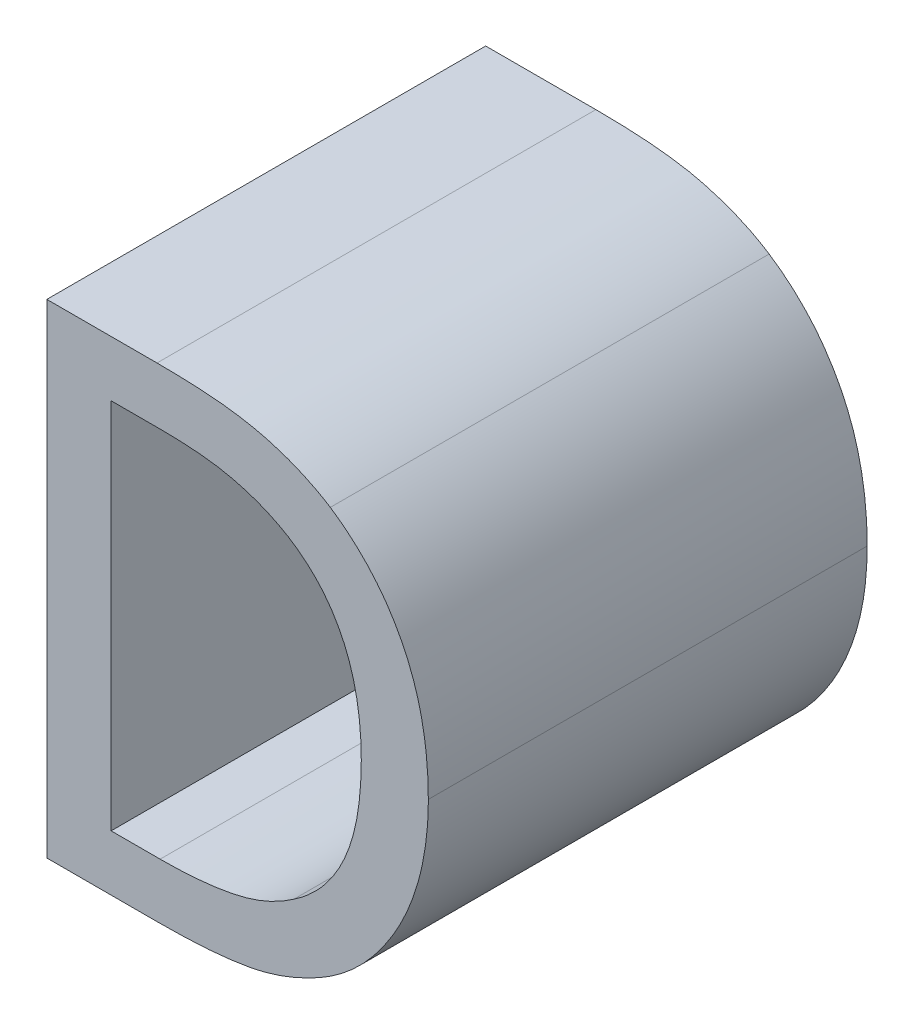
ISO-10303-21;
HEADER;
FILE_DESCRIPTION(('STEP AP214'),'2;1');
FILE_NAME('part.step','',(''),(''),'','','');
FILE_SCHEMA(('AUTOMOTIVE_DESIGN { 1 0 10303 214 1 1 1 1 }'));
ENDSEC;
DATA;
#1=APPLICATION_CONTEXT('core data for automotive mechanical design processes');
#2=APPLICATION_PROTOCOL_DEFINITION('international standard','automotive_design',2000,#1);
#3=PRODUCT_CONTEXT('',#1,'mechanical');
#4=PRODUCT('Part','Part','',(#3));
#5=PRODUCT_RELATED_PRODUCT_CATEGORY('part','',(#4));
#6=PRODUCT_DEFINITION_FORMATION('','',#4);
#7=PRODUCT_DEFINITION_CONTEXT('part definition',#1,'design');
#8=PRODUCT_DEFINITION('design','',#6,#7);
#9=PRODUCT_DEFINITION_SHAPE('','',#8);
#10=(LENGTH_UNIT() NAMED_UNIT(*) SI_UNIT(.MILLI.,.METRE.));
#11=(NAMED_UNIT(*) PLANE_ANGLE_UNIT() SI_UNIT($,.RADIAN.));
#12=(NAMED_UNIT(*) SI_UNIT($,.STERADIAN.) SOLID_ANGLE_UNIT());
#13=UNCERTAINTY_MEASURE_WITH_UNIT(LENGTH_MEASURE(1.E-05),#10,'distance_accuracy_value','');
#14=(GEOMETRIC_REPRESENTATION_CONTEXT(3) GLOBAL_UNCERTAINTY_ASSIGNED_CONTEXT((#13)) GLOBAL_UNIT_ASSIGNED_CONTEXT((#10,
#11,#12)) REPRESENTATION_CONTEXT('',''));
#15=CARTESIAN_POINT('',(0.,0.,0.));
#16=DIRECTION('',(0.,0.,1.));
#17=DIRECTION('',(1.,0.,0.));
#18=AXIS2_PLACEMENT_3D('',#15,#16,#17);
#19=CARTESIAN_POINT('',(-0.57336018621223,-0.78151699205063,0.));
#20=CARTESIAN_POINT('',(-0.57336018621223,-0.78151699205063,0.1));
#21=CARTESIAN_POINT('',(-0.565676636526099,-0.776335063192542,0.));
#22=CARTESIAN_POINT('',(-0.565676636526099,-0.776335063192542,0.1));
#23=CARTESIAN_POINT('',(-0.557993086839968,-0.759181091800249,0.));
#24=CARTESIAN_POINT('',(-0.557993086839968,-0.759181091800249,0.1));
#25=CARTESIAN_POINT('',(-0.557993086839968,-0.746315613256029,0.));
#26=CARTESIAN_POINT('',(-0.557993086839968,-0.746315613256029,0.1));
#27=B_SPLINE_SURFACE_WITH_KNOTS('',2,1,((#19,#20),(#21,#22),(#23,#24),(#25,#26)),.UNSPECIFIED.,
.F.,.F.,.F.,(3,1,3),(2,2),(0.,0.5,1.),(0.,1.),.UNSPECIFIED.);
#28=CARTESIAN_POINT('',(-0.57336018621223,-0.78151699205063,0.));
#29=CARTESIAN_POINT('',(-0.571974064499115,-0.780586004854194,0.));
#30=CARTESIAN_POINT('',(-0.570659374096423,-0.779549621493118,0.));
#31=CARTESIAN_POINT('',(-0.568210307998909,-0.777289324570812,0.));
#32=CARTESIAN_POINT('',(-0.567075393979872,-0.776065993286295,0.));
#33=CARTESIAN_POINT('',(-0.564032264183,-0.772201998895634,0.));
#34=CARTESIAN_POINT('',(-0.56241804529149,-0.769321800062823,0.));
#35=CARTESIAN_POINT('',(-0.559920581166913,-0.763013413304652,0.));
#36=CARTESIAN_POINT('',(-0.559110338615604,-0.759559503613566,0.));
#37=CARTESIAN_POINT('',(-0.558179322670335,-0.752819033089759,0.));
#38=CARTESIAN_POINT('',(-0.558010958480128,-0.749539622327566,0.));
#39=CARTESIAN_POINT('',(-0.557993086839968,-0.746315613256029,0.));
#40=B_SPLINE_CURVE_WITH_KNOTS('',3,(#28,#29,#30,#31,#32,#33,#34,#35,#36,#37,#38,#39),
.UNSPECIFIED.,.F.,.F.,(4,2,2,2,2,4),(0.,0.00500283621021951,0.00999039651425222,
0.0197318708524399,0.030293679025087,0.0400551929748056),.UNSPECIFIED.);
#41=CARTESIAN_POINT('',(-0.57336018621223,-0.78151699205063,0.));
#42=VERTEX_POINT('',#41);
#43=CARTESIAN_POINT('',(-0.557993086839968,-0.746315613256029,0.));
#44=VERTEX_POINT('',#43);
#45=EDGE_CURVE('E11',#42,#44,#40,.T.);
#46=DIRECTION('',(0.,0.,1.));
#47=VECTOR('',#46,1.);
#48=CARTESIAN_POINT('',(-0.57336018621223,-0.78151699205063,0.));
#49=LINE('',#48,#47);
#50=CARTESIAN_POINT('',(-0.57336018621223,-0.78151699205063,0.1));
#51=VERTEX_POINT('',#50);
#52=EDGE_CURVE('E254',#42,#51,#49,.T.);
#53=CARTESIAN_POINT('',(-0.557993086839968,-0.746315613256029,0.1));
#54=CARTESIAN_POINT('',(-0.55800529303414,-0.748901372805465,0.1));
#55=CARTESIAN_POINT('',(-0.558113369773259,-0.75150009986584,0.1));
#56=CARTESIAN_POINT('',(-0.558656851746064,-0.756695599338601,0.1));
#57=CARTESIAN_POINT('',(-0.559096649048212,-0.759291873337756,0.1));
#58=CARTESIAN_POINT('',(-0.560664166489674,-0.765204023709619,0.1));
#59=CARTESIAN_POINT('',(-0.56196829723751,-0.768481239153434,0.1));
#60=CARTESIAN_POINT('',(-0.565382887417428,-0.77413702258923,0.1));
#61=CARTESIAN_POINT('',(-0.567394379080186,-0.776573802677838,0.1));
#62=CARTESIAN_POINT('',(-0.570854142771335,-0.779706084052975,0.1));
#63=CARTESIAN_POINT('',(-0.572076166423392,-0.780660618383883,0.1));
#64=CARTESIAN_POINT('',(-0.573360186269095,-0.781516992088981,0.1));
#65=B_SPLINE_CURVE_WITH_KNOTS('',3,(#53,#54,#55,#56,#57,#58,#59,#60,#61,#62,#63,#64),
.UNSPECIFIED.,.F.,.F.,(4,2,2,2,2,4),(0.,0.00777464567562108,0.0156540772552479,
0.0260804222293015,0.0354127228769543,0.0400469014535127),.UNSPECIFIED.);
#66=CARTESIAN_POINT('',(-0.557993086839968,-0.746315613256029,0.1));
#67=VERTEX_POINT('',#66);
#68=EDGE_CURVE('E261',#67,#51,#65,.T.);
#69=DIRECTION('',(0.,0.,1.));
#70=VECTOR('',#69,1.);
#71=CARTESIAN_POINT('',(-0.557993086839968,-0.746315613256029,0.));
#72=LINE('',#71,#70);
#73=EDGE_CURVE('E280',#44,#67,#72,.T.);
#74=ORIENTED_EDGE('',*,*,#45,.F.);
#75=ORIENTED_EDGE('',*,*,#52,.T.);
#76=ORIENTED_EDGE('',*,*,#68,.F.);
#77=ORIENTED_EDGE('',*,*,#73,.F.);
#78=EDGE_LOOP('',(#74,#75,#76,#77));
#79=FACE_BOUND('',#78,.T.);
#80=ADVANCED_FACE('F17',(#79),#27,.F.);
#81=CARTESIAN_POINT('',(-0.603826354153751,-0.788843167332755,0.));
#82=CARTESIAN_POINT('',(-0.603826354153751,-0.788843167332755,0.1));
#83=CARTESIAN_POINT('',(-0.594087901644584,-0.788843167332755,0.));
#84=CARTESIAN_POINT('',(-0.594087901644584,-0.788843167332755,0.1));
#85=CARTESIAN_POINT('',(-0.579346207479332,-0.785716141297702,0.));
#86=CARTESIAN_POINT('',(-0.579346207479332,-0.785716141297702,0.1));
#87=CARTESIAN_POINT('',(-0.57336018621223,-0.78151699205063,0.));
#88=CARTESIAN_POINT('',(-0.57336018621223,-0.78151699205063,0.1));
#89=B_SPLINE_SURFACE_WITH_KNOTS('',2,1,((#81,#82),(#83,#84),(#85,#86),(#87,#88)),.UNSPECIFIED.,
.F.,.F.,.F.,(3,1,3),(2,2),(0.,0.5,1.),(0.,1.),.UNSPECIFIED.);
#90=CARTESIAN_POINT('',(-0.603826354153751,-0.788843167332755,0.));
#91=CARTESIAN_POINT('',(-0.600998347678531,-0.788810860575393,0.));
#92=CARTESIAN_POINT('',(-0.598149254573237,-0.788730772281216,0.));
#93=CARTESIAN_POINT('',(-0.592422383887495,-0.788280432587895,0.));
#94=CARTESIAN_POINT('',(-0.589545102750384,-0.78790465063708,0.));
#95=CARTESIAN_POINT('',(-0.584873881218276,-0.786872314523407,0.));
#96=CARTESIAN_POINT('',(-0.583051620790868,-0.786359114745231,0.));
#97=CARTESIAN_POINT('',(-0.579527640772833,-0.785043280695589,0.));
#98=CARTESIAN_POINT('',(-0.577825128337813,-0.784242818339729,0.));
#99=CARTESIAN_POINT('',(-0.575223217417328,-0.782759856601411,0.));
#100=CARTESIAN_POINT('',(-0.574276194469187,-0.78215938182593,0.));
#101=CARTESIAN_POINT('',(-0.573360186168784,-0.781516992020153,0.));
#102=B_SPLINE_CURVE_WITH_KNOTS('',3,(#90,#91,#92,#93,#94,#95,#96,#97,#98,#99,#100,#101),
.UNSPECIFIED.,.F.,.F.,(4,2,2,2,2,4),(0.,0.00851996682632826,0.0172031889020703,0.02286245720336,
0.0284798088608754,0.0318380470037039),.UNSPECIFIED.);
#103=CARTESIAN_POINT('',(-0.603826354153751,-0.788843167332755,0.));
#104=VERTEX_POINT('',#103);
#105=EDGE_CURVE('E32',#104,#42,#102,.T.);
#106=DIRECTION('',(0.,0.,1.));
#107=VECTOR('',#106,1.);
#108=CARTESIAN_POINT('',(-0.603826354153751,-0.788843167332755,0.));
#109=LINE('',#108,#107);
#110=CARTESIAN_POINT('',(-0.603826354153751,-0.788843167332755,0.1));
#111=VERTEX_POINT('',#110);
#112=EDGE_CURVE('E259',#104,#111,#109,.T.);
#113=CARTESIAN_POINT('',(-0.57336018621223,-0.78151699205063,0.1));
#114=CARTESIAN_POINT('',(-0.574853987948286,-0.782566061308256,0.1));
#115=CARTESIAN_POINT('',(-0.576430543282242,-0.783499948944935,0.1));
#116=CARTESIAN_POINT('',(-0.579683438222522,-0.785103860242563,0.1));
#117=CARTESIAN_POINT('',(-0.581357950903033,-0.785777592253888,0.1));
#118=CARTESIAN_POINT('',(-0.585044688873533,-0.786941088179583,0.1));
#119=CARTESIAN_POINT('',(-0.587069928987957,-0.787388178881423,0.1));
#120=CARTESIAN_POINT('',(-0.591158158191194,-0.788084165524177,0.1));
#121=CARTESIAN_POINT('',(-0.593221277910507,-0.78833214200787,0.1));
#122=CARTESIAN_POINT('',(-0.596715204522803,-0.788625454054499,0.1));
#123=CARTESIAN_POINT('',(-0.598142821825889,-0.788709848031575,0.1));
#124=CARTESIAN_POINT('',(-0.60098925672141,-0.788818344146986,0.1));
#125=CARTESIAN_POINT('',(-0.602408056017505,-0.788842911767725,0.1));
#126=CARTESIAN_POINT('',(-0.603826354153751,-0.788843167332755,0.1));
#127=B_SPLINE_CURVE_WITH_KNOTS('',3,(#113,#114,#115,#116,#117,#118,#119,#120,#121,#122,#123,
#124,#125,#126),.UNSPECIFIED.,.F.,.F.,(4,2,2,2,2,2,4),(0.,0.00547388563976892,0.010866578802471,
0.0170670445424434,0.0232959803481711,0.0275849281018604,0.0318403972934729),.UNSPECIFIED.);
#128=EDGE_CURVE('E273',#51,#111,#127,.T.);
#129=ORIENTED_EDGE('',*,*,#105,.F.);
#130=ORIENTED_EDGE('',*,*,#112,.T.);
#131=ORIENTED_EDGE('',*,*,#128,.F.);
#132=ORIENTED_EDGE('',*,*,#52,.F.);
#133=EDGE_LOOP('',(#129,#130,#131,#132));
#134=FACE_BOUND('',#133,.T.);
#135=ADVANCED_FACE('F196',(#134),#89,.F.);
#136=CARTESIAN_POINT('',(-0.614994304278941,-0.788843167332755,0.));
#137=DIRECTION('',(0.,-1.,0.));
#138=DIRECTION('',(1.,0.,0.));
#139=AXIS2_PLACEMENT_3D('',#136,#137,#138);
#140=PLANE('',#139);
#141=DIRECTION('',(1.,0.,0.));
#142=VECTOR('',#141,1.);
#143=CARTESIAN_POINT('',(-0.614994304278941,-0.788843167332755,0.));
#144=LINE('',#143,#142);
#145=CARTESIAN_POINT('',(-0.614994304278941,-0.788843167332755,0.));
#146=VERTEX_POINT('',#145);
#147=EDGE_CURVE('E256',#146,#104,#144,.T.);
#148=ORIENTED_EDGE('',*,*,#147,.F.);
#149=DIRECTION('',(0.,0.,1.));
#150=VECTOR('',#149,1.);
#151=CARTESIAN_POINT('',(-0.614994304278941,-0.788843167332755,0.));
#152=LINE('',#151,#150);
#153=CARTESIAN_POINT('',(-0.614994304278941,-0.788843167332755,0.1));
#154=VERTEX_POINT('',#153);
#155=EDGE_CURVE('E271',#146,#154,#152,.T.);
#156=ORIENTED_EDGE('',*,*,#155,.T.);
#157=DIRECTION('',(-1.,0.,0.));
#158=VECTOR('',#157,1.);
#159=CARTESIAN_POINT('',(-0.603826354153751,-0.788843167332755,0.1));
#160=LINE('',#159,#158);
#161=EDGE_CURVE('E287',#111,#154,#160,.T.);
#162=ORIENTED_EDGE('',*,*,#161,.F.);
#163=ORIENTED_EDGE('',*,*,#112,.F.);
#164=EDGE_LOOP('',(#148,#156,#162,#163));
#165=FACE_BOUND('',#164,.T.);
#166=ADVANCED_FACE('F195',(#165),#140,.F.);
#167=CARTESIAN_POINT('',(-0.614994304278941,-0.703966746381305,0.));
#168=DIRECTION('',(-1.,0.,0.));
#169=DIRECTION('',(0.,-1.,0.));
#170=AXIS2_PLACEMENT_3D('',#167,#168,#169);
#171=PLANE('',#170);
#172=DIRECTION('',(0.,-1.,0.));
#173=VECTOR('',#172,1.);
#174=CARTESIAN_POINT('',(-0.614994304278941,-0.703966746381305,0.));
#175=LINE('',#174,#173);
#176=CARTESIAN_POINT('',(-0.614994304278941,-0.703966746381305,0.));
#177=VERTEX_POINT('',#176);
#178=EDGE_CURVE('E268',#177,#146,#175,.T.);
#179=ORIENTED_EDGE('',*,*,#178,.F.);
#180=DIRECTION('',(0.,0.,1.));
#181=VECTOR('',#180,1.);
#182=CARTESIAN_POINT('',(-0.614994304278941,-0.703966746381305,0.));
#183=LINE('',#182,#181);
#184=CARTESIAN_POINT('',(-0.614994304278941,-0.703966746381305,0.1));
#185=VERTEX_POINT('',#184);
#186=EDGE_CURVE('E286',#177,#185,#183,.T.);
#187=ORIENTED_EDGE('',*,*,#186,.T.);
#188=DIRECTION('',(0.,1.,0.));
#189=VECTOR('',#188,1.);
#190=CARTESIAN_POINT('',(-0.614994304278941,-0.788843167332755,0.1));
#191=LINE('',#190,#189);
#192=EDGE_CURVE('E295',#154,#185,#191,.T.);
#193=ORIENTED_EDGE('',*,*,#192,.F.);
#194=ORIENTED_EDGE('',*,*,#155,.F.);
#195=EDGE_LOOP('',(#179,#187,#193,#194));
#196=FACE_BOUND('',#195,.T.);
#197=ADVANCED_FACE('F403',(#196),#171,.F.);
#198=CARTESIAN_POINT('',(-0.603826354153751,-0.703966746381305,0.));
#199=DIRECTION('',(0.,1.,0.));
#200=DIRECTION('',(-1.,0.,0.));
#201=AXIS2_PLACEMENT_3D('',#198,#199,#200);
#202=PLANE('',#201);
#203=DIRECTION('',(-1.,0.,0.));
#204=VECTOR('',#203,1.);
#205=CARTESIAN_POINT('',(-0.603826354153751,-0.703966746381305,0.));
#206=LINE('',#205,#204);
#207=CARTESIAN_POINT('',(-0.603826354153751,-0.703966746381305,0.));
#208=VERTEX_POINT('',#207);
#209=EDGE_CURVE('E283',#208,#177,#206,.T.);
#210=ORIENTED_EDGE('',*,*,#209,.F.);
#211=DIRECTION('',(0.,0.,1.));
#212=VECTOR('',#211,1.);
#213=CARTESIAN_POINT('',(-0.603826354153751,-0.703966746381305,0.));
#214=LINE('',#213,#212);
#215=CARTESIAN_POINT('',(-0.603826354153751,-0.703966746381305,0.1));
#216=VERTEX_POINT('',#215);
#217=EDGE_CURVE('E292',#208,#216,#214,.T.);
#218=ORIENTED_EDGE('',*,*,#217,.T.);
#219=DIRECTION('',(1.,0.,0.));
#220=VECTOR('',#219,1.);
#221=CARTESIAN_POINT('',(-0.614994304278941,-0.703966746381305,0.1));
#222=LINE('',#221,#220);
#223=EDGE_CURVE('E304',#185,#216,#222,.T.);
#224=ORIENTED_EDGE('',*,*,#223,.F.);
#225=ORIENTED_EDGE('',*,*,#186,.F.);
#226=EDGE_LOOP('',(#210,#218,#224,#225));
#227=FACE_BOUND('',#226,.T.);
#228=ADVANCED_FACE('F327',(#227),#202,.F.);
#229=CARTESIAN_POINT('',(-0.574700340227253,-0.710578172855418,0.));
#230=CARTESIAN_POINT('',(-0.574700340227253,-0.710578172855418,0.1));
#231=CARTESIAN_POINT('',(-0.580597017893354,-0.707093772416359,0.));
#232=CARTESIAN_POINT('',(-0.580597017893354,-0.707093772416359,0.1));
#233=CARTESIAN_POINT('',(-0.593909214442581,-0.703966746381305,0.));
#234=CARTESIAN_POINT('',(-0.593909214442581,-0.703966746381305,0.1));
#235=CARTESIAN_POINT('',(-0.603826354153751,-0.703966746381305,0.));
#236=CARTESIAN_POINT('',(-0.603826354153751,-0.703966746381305,0.1));
#237=B_SPLINE_SURFACE_WITH_KNOTS('',2,1,((#229,#230),(#231,#232),(#233,#234),(#235,#236)),
.UNSPECIFIED.,.F.,.F.,.F.,(3,1,3),(2,2),(0.,0.5,1.),(0.,1.),.UNSPECIFIED.);
#238=CARTESIAN_POINT('',(-0.574700340227253,-0.710578172855418,0.));
#239=CARTESIAN_POINT('',(-0.576657726956662,-0.709415813427964,0.));
#240=CARTESIAN_POINT('',(-0.578707935494003,-0.708406786820412,0.));
#241=CARTESIAN_POINT('',(-0.58291209872132,-0.706722584762168,0.));
#242=CARTESIAN_POINT('',(-0.585064475406915,-0.706043472146908,0.));
#243=CARTESIAN_POINT('',(-0.590130077472695,-0.704855642877207,0.));
#244=CARTESIAN_POINT('',(-0.593069699541249,-0.704467685046455,0.));
#245=CARTESIAN_POINT('',(-0.59862468685714,-0.704051212499679,0.));
#246=CARTESIAN_POINT('',(-0.601237003851355,-0.703985413066877,0.));
#247=CARTESIAN_POINT('',(-0.603826354153751,-0.703966746381305,0.));
#248=B_SPLINE_CURVE_WITH_KNOTS('',3,(#238,#239,#240,#241,#242,#243,#244,#245,#246,#247),
.UNSPECIFIED.,.F.,.F.,(4,2,2,2,4),(0.,0.00682634382907425,0.0135690891273074,0.0224324063312279,
0.0302408276179127),.UNSPECIFIED.);
#249=CARTESIAN_POINT('',(-0.574700340227253,-0.710578172855418,0.));
#250=VERTEX_POINT('',#249);
#251=EDGE_CURVE('E241',#250,#208,#248,.T.);
#252=DIRECTION('',(0.,0.,1.));
#253=VECTOR('',#252,1.);
#254=CARTESIAN_POINT('',(-0.574700340227253,-0.710578172855418,0.));
#255=LINE('',#254,#253);
#256=CARTESIAN_POINT('',(-0.574700340227253,-0.710578172855418,0.1));
#257=VERTEX_POINT('',#256);
#258=EDGE_CURVE('E302',#250,#257,#255,.T.);
#259=CARTESIAN_POINT('',(-0.603826354153751,-0.703966746381305,0.1));
#260=CARTESIAN_POINT('',(-0.601454331224949,-0.703986630810853,0.1));
#261=CARTESIAN_POINT('',(-0.599070082027118,-0.704040470982053,0.1));
#262=CARTESIAN_POINT('',(-0.5943051386019,-0.704354529130428,0.1));
#263=CARTESIAN_POINT('',(-0.591924523201463,-0.704615788463975,0.1));
#264=CARTESIAN_POINT('',(-0.586796075436872,-0.705564067395508,0.1));
#265=CARTESIAN_POINT('',(-0.584059301212245,-0.706319276136312,0.1));
#266=CARTESIAN_POINT('',(-0.579091148890737,-0.70821246717781,0.1));
#267=CARTESIAN_POINT('',(-0.576838241787665,-0.709294763107922,0.1));
#268=CARTESIAN_POINT('',(-0.574700340226908,-0.710578172855622,0.1));
#269=B_SPLINE_CURVE_WITH_KNOTS('',3,(#259,#260,#261,#262,#263,#264,#265,#266,#267,#268),
.UNSPECIFIED.,.F.,.F.,(4,2,2,2,4),(0.,0.0071364590816535,0.0143089753629661,0.0227729142928161,
0.0302380546586502),.UNSPECIFIED.);
#270=EDGE_CURVE('E310',#216,#257,#269,.T.);
#271=ORIENTED_EDGE('',*,*,#251,.F.);
#272=ORIENTED_EDGE('',*,*,#258,.T.);
#273=ORIENTED_EDGE('',*,*,#270,.F.);
#274=ORIENTED_EDGE('',*,*,#217,.F.);
#275=EDGE_LOOP('',(#271,#272,#273,#274));
#276=FACE_BOUND('',#275,.T.);
#277=ADVANCED_FACE('F321',(#276),#237,.F.);
#278=CARTESIAN_POINT('',(-0.557993086839968,-0.746315613256029,0.));
#279=CARTESIAN_POINT('',(-0.557993086839968,-0.746315613256029,0.1));
#280=CARTESIAN_POINT('',(-0.557993086839968,-0.733628821913812,0.));
#281=CARTESIAN_POINT('',(-0.557993086839968,-0.733628821913812,0.1));
#282=CARTESIAN_POINT('',(-0.566391385334111,-0.715670758112505,0.));
#283=CARTESIAN_POINT('',(-0.566391385334111,-0.715670758112505,0.1));
#284=CARTESIAN_POINT('',(-0.574700340227253,-0.710578172855418,0.));
#285=CARTESIAN_POINT('',(-0.574700340227253,-0.710578172855418,0.1));
#286=B_SPLINE_SURFACE_WITH_KNOTS('',2,1,((#278,#279),(#280,#281),(#282,#283),(#284,#285)),
.UNSPECIFIED.,.F.,.F.,.F.,(3,1,3),(2,2),(0.,0.5,1.),(0.,1.),.UNSPECIFIED.);
#287=CARTESIAN_POINT('',(-0.557993086839968,-0.746315613256029,0.));
#288=CARTESIAN_POINT('',(-0.557959509728808,-0.741139915722406,0.));
#289=CARTESIAN_POINT('',(-0.558519919090316,-0.73571167763851,0.));
#290=CARTESIAN_POINT('',(-0.561016647058077,-0.726998213032469,0.));
#291=CARTESIAN_POINT('',(-0.562488936815164,-0.723559158622996,0.));
#292=CARTESIAN_POINT('',(-0.566291207498108,-0.717733426259584,0.));
#293=CARTESIAN_POINT('',(-0.568494631272529,-0.71526954434082,0.));
#294=CARTESIAN_POINT('',(-0.572175234662628,-0.712235728864771,0.));
#295=CARTESIAN_POINT('',(-0.573410260914859,-0.711357766191204,0.));
#296=CARTESIAN_POINT('',(-0.57470034027659,-0.710578172825179,0.));
#297=B_SPLINE_CURVE_WITH_KNOTS('',3,(#287,#288,#289,#290,#291,#292,#293,#294,#295,#296),
.UNSPECIFIED.,.F.,.F.,(4,2,2,2,4),(0.,0.0158570587072416,0.0269494136922648,0.0366884533504587,
0.0412169932588302),.UNSPECIFIED.);
#298=EDGE_CURVE('E232',#44,#250,#297,.T.);
#299=CARTESIAN_POINT('',(-0.574700340227253,-0.710578172855418,0.1));
#300=CARTESIAN_POINT('',(-0.57327283938763,-0.711449876515216,0.1));
#301=CARTESIAN_POINT('',(-0.571910963108992,-0.712429788245306,0.1));
#302=CARTESIAN_POINT('',(-0.56936098449595,-0.714584624259187,0.1));
#303=CARTESIAN_POINT('',(-0.568172221671367,-0.715758768758344,0.1));
#304=CARTESIAN_POINT('',(-0.564957847706391,-0.719499747584693,0.1));
#305=CARTESIAN_POINT('',(-0.56322219935086,-0.722322798713447,0.1));
#306=CARTESIAN_POINT('',(-0.560358360050504,-0.728751066819723,0.1));
#307=CARTESIAN_POINT('',(-0.559363064717779,-0.732409917858069,0.1));
#308=CARTESIAN_POINT('',(-0.558217786062408,-0.739511183820056,0.1));
#309=CARTESIAN_POINT('',(-0.557997028629576,-0.74294153578894,0.1));
#310=CARTESIAN_POINT('',(-0.557993086839968,-0.746315613256029,0.1));
#311=B_SPLINE_CURVE_WITH_KNOTS('',3,(#299,#300,#301,#302,#303,#304,#305,#306,#307,#308,#309,
#310),.UNSPECIFIED.,.F.,.F.,(4,2,2,2,2,4),(0.,0.00501309103515068,0.0100065238851362,
0.0197859510157936,0.0310558260920404,0.0412644624954488),.UNSPECIFIED.);
#312=EDGE_CURVE('E350',#257,#67,#311,.T.);
#313=ORIENTED_EDGE('',*,*,#298,.F.);
#314=ORIENTED_EDGE('',*,*,#73,.T.);
#315=ORIENTED_EDGE('',*,*,#312,.F.);
#316=ORIENTED_EDGE('',*,*,#258,.F.);
#317=EDGE_LOOP('',(#313,#314,#315,#316));
#318=FACE_BOUND('',#317,.T.);
#319=ADVANCED_FACE('F326',(#318),#286,.F.);
#320=CARTESIAN_POINT('',(-0.604273072158758,-0.801529958674972,0.));
#321=CARTESIAN_POINT('',(-0.604273072158758,-0.801529958674972,0.1));
#322=CARTESIAN_POINT('',(-0.590871532008529,-0.801529958674972,0.));
#323=CARTESIAN_POINT('',(-0.590871532008529,-0.801529958674972,0.1));
#324=CARTESIAN_POINT('',(-0.573628217015235,-0.797956214634911,0.));
#325=CARTESIAN_POINT('',(-0.573628217015235,-0.797956214634911,0.1));
#326=CARTESIAN_POINT('',(-0.565229918521091,-0.792684942175821,0.));
#327=CARTESIAN_POINT('',(-0.565229918521091,-0.792684942175821,0.1));
#328=B_SPLINE_SURFACE_WITH_KNOTS('',2,1,((#320,#321),(#322,#323),(#324,#325),(#326,#327)),
.UNSPECIFIED.,.F.,.F.,.F.,(3,1,3),(2,2),(0.,0.5,1.),(0.,1.),.UNSPECIFIED.);
#329=CARTESIAN_POINT('',(-0.565229918521091,-0.792684942175821,0.));
#330=CARTESIAN_POINT('',(-0.567496832987165,-0.794111565603525,0.));
#331=CARTESIAN_POINT('',(-0.569868866812667,-0.795397890975192,0.));
#332=CARTESIAN_POINT('',(-0.574765928221522,-0.797592615126974,0.));
#333=CARTESIAN_POINT('',(-0.57729014487795,-0.798502843782643,0.));
#334=CARTESIAN_POINT('',(-0.580717758707997,-0.799405645921311,0.));
#335=CARTESIAN_POINT('',(-0.581568019190788,-0.79960341855893,0.));
#336=CARTESIAN_POINT('',(-0.582774612410247,-0.799850769780805,0.));
#337=CARTESIAN_POINT('',(-0.583127202569641,-0.799919074462566,0.));
#338=CARTESIAN_POINT('',(-0.583967230433343,-0.800074694664684,0.));
#339=CARTESIAN_POINT('',(-0.5844551505464,-0.800159409283244,0.));
#340=CARTESIAN_POINT('',(-0.585977602148305,-0.800407148634764,0.));
#341=CARTESIAN_POINT('',(-0.587015080074665,-0.800552183956896,0.));
#342=CARTESIAN_POINT('',(-0.590364934757598,-0.800961567263514,0.));
#343=CARTESIAN_POINT('',(-0.592685562656194,-0.801155056932992,0.));
#344=CARTESIAN_POINT('',(-0.598095516323642,-0.801458232532555,0.));
#345=CARTESIAN_POINT('',(-0.601187968732921,-0.801519798270681,0.));
#346=CARTESIAN_POINT('',(-0.604273072158758,-0.801529958674972,0.));
#347=B_SPLINE_CURVE_WITH_KNOTS('',3,(#329,#330,#331,#332,#333,#334,#335,#336,#337,#338,#339,
#340,#341,#342,#343,#344,#345,#346),.UNSPECIFIED.,.F.,.F.,(4,2,2,2,2,2,2,2,4),(0.,
0.00805339564730966,0.0160671330016026,0.018684662178075,0.0197620521479191,0.02124759715595,
0.0243893348672457,0.0313713374872011,0.0406373415204647),.UNSPECIFIED.);
#348=CARTESIAN_POINT('',(-0.565229918521091,-0.792684942175821,0.));
#349=VERTEX_POINT('',#348);
#350=CARTESIAN_POINT('',(-0.604273072158758,-0.801529958674972,0.));
#351=VERTEX_POINT('',#350);
#352=EDGE_CURVE('E222',#349,#351,#347,.T.);
#353=DIRECTION('',(0.,0.,1.));
#354=VECTOR('',#353,1.);
#355=CARTESIAN_POINT('',(-0.565229918521091,-0.792684942175821,0.));
#356=LINE('',#355,#354);
#357=CARTESIAN_POINT('',(-0.565229918521091,-0.792684942175821,0.1));
#358=VERTEX_POINT('',#357);
#359=EDGE_CURVE('E314',#349,#358,#356,.T.);
#360=CARTESIAN_POINT('',(-0.604273072158758,-0.801529958674972,0.1));
#361=CARTESIAN_POINT('',(-0.601219163888686,-0.801517302314076,0.1));
#362=CARTESIAN_POINT('',(-0.598155200346214,-0.801458239991918,0.1));
#363=CARTESIAN_POINT('',(-0.592029736365176,-0.801121734312689,0.1));
#364=CARTESIAN_POINT('',(-0.588968284433141,-0.800843506168223,0.1));
#365=CARTESIAN_POINT('',(-0.584639940469335,-0.800200802316472,0.1));
#366=CARTESIAN_POINT('',(-0.583353588959824,-0.799977959885216,0.1));
#367=CARTESIAN_POINT('',(-0.581732131970008,-0.799633676641932,0.1));
#368=CARTESIAN_POINT('',(-0.581387549105648,-0.799556828946696,0.1));
#369=CARTESIAN_POINT('',(-0.580583645183135,-0.799367375592144,0.1));
#370=CARTESIAN_POINT('',(-0.580125095273077,-0.799251488698491,0.1));
#371=CARTESIAN_POINT('',(-0.578746175966472,-0.798880521979874,0.1));
#372=CARTESIAN_POINT('',(-0.577831523384328,-0.798603971978608,0.1));
#373=CARTESIAN_POINT('',(-0.575068804143252,-0.797677799245675,0.1));
#374=CARTESIAN_POINT('',(-0.573249715544991,-0.79694148504345,0.1));
#375=CARTESIAN_POINT('',(-0.569323983714086,-0.795099021828121,0.1));
#376=CARTESIAN_POINT('',(-0.567238295923729,-0.793947541791572,0.1));
#377=CARTESIAN_POINT('',(-0.565229918517566,-0.792684942173609,0.1));
#378=B_SPLINE_CURVE_WITH_KNOTS('',3,(#360,#361,#362,#363,#364,#365,#366,#367,#368,#369,#370,
#371,#372,#373,#374,#375,#376,#377),.UNSPECIFIED.,.F.,.F.,(4,2,2,2,2,2,2,2,4),(0.,
0.00917823487791914,0.0183894853398582,0.0223030934659547,0.0233621533376991,0.024780835593121,
0.0276456666761706,0.033520479488062,0.0406426922113411),.UNSPECIFIED.);
#379=CARTESIAN_POINT('',(-0.604273072158758,-0.801529958674972,0.1));
#380=VERTEX_POINT('',#379);
#381=EDGE_CURVE('E148',#380,#358,#378,.T.);
#382=DIRECTION('',(0.,0.,1.));
#383=VECTOR('',#382,1.);
#384=CARTESIAN_POINT('',(-0.604273072158758,-0.801529958674972,0.));
#385=LINE('',#384,#383);
#386=EDGE_CURVE('E360',#351,#380,#385,.T.);
#387=ORIENTED_EDGE('',*,*,#352,.F.);
#388=ORIENTED_EDGE('',*,*,#359,.T.);
#389=ORIENTED_EDGE('',*,*,#381,.F.);
#390=ORIENTED_EDGE('',*,*,#386,.F.);
#391=EDGE_LOOP('',(#387,#388,#389,#390));
#392=FACE_BOUND('',#391,.T.);
#393=ADVANCED_FACE('F328',(#392),#328,.T.);
#394=CARTESIAN_POINT('',(-0.629646654843192,-0.801529958674972,0.));
#395=DIRECTION('',(0.,-1.,0.));
#396=DIRECTION('',(1.,0.,0.));
#397=AXIS2_PLACEMENT_3D('',#394,#395,#396);
#398=PLANE('',#397);
#399=DIRECTION('',(-1.,0.,0.));
#400=VECTOR('',#399,1.);
#401=CARTESIAN_POINT('',(-0.604273072158758,-0.801529958674972,0.));
#402=LINE('',#401,#400);
#403=CARTESIAN_POINT('',(-0.629646654843192,-0.801529958674972,0.));
#404=VERTEX_POINT('',#403);
#405=EDGE_CURVE('E312',#351,#404,#402,.T.);
#406=ORIENTED_EDGE('',*,*,#405,.F.);
#407=ORIENTED_EDGE('',*,*,#386,.T.);
#408=DIRECTION('',(1.,0.,0.));
#409=VECTOR('',#408,1.);
#410=CARTESIAN_POINT('',(-0.629646654843192,-0.801529958674972,0.1));
#411=LINE('',#410,#409);
#412=CARTESIAN_POINT('',(-0.629646654843192,-0.801529958674972,0.1));
#413=VERTEX_POINT('',#412);
#414=EDGE_CURVE('E381',#413,#380,#411,.T.);
#415=ORIENTED_EDGE('',*,*,#414,.F.);
#416=DIRECTION('',(0.,0.,1.));
#417=VECTOR('',#416,1.);
#418=CARTESIAN_POINT('',(-0.629646654843192,-0.801529958674972,0.));
#419=LINE('',#418,#417);
#420=EDGE_CURVE('E378',#404,#413,#419,.T.);
#421=ORIENTED_EDGE('',*,*,#420,.F.);
#422=EDGE_LOOP('',(#406,#407,#415,#421));
#423=FACE_BOUND('',#422,.T.);
#424=ADVANCED_FACE('F383',(#423),#398,.T.);
#425=CARTESIAN_POINT('',(-0.629646654843192,-0.691279955039089,0.));
#426=DIRECTION('',(-1.,0.,0.));
#427=DIRECTION('',(0.,-1.,0.));
#428=AXIS2_PLACEMENT_3D('',#425,#426,#427);
#429=PLANE('',#428);
#430=DIRECTION('',(0.,1.,0.));
#431=VECTOR('',#430,1.);
#432=CARTESIAN_POINT('',(-0.629646654843192,-0.801529958674972,0.));
#433=LINE('',#432,#431);
#434=CARTESIAN_POINT('',(-0.629646654843192,-0.691279955039089,0.));
#435=VERTEX_POINT('',#434);
#436=EDGE_CURVE('E356',#404,#435,#433,.T.);
#437=ORIENTED_EDGE('',*,*,#436,.F.);
#438=ORIENTED_EDGE('',*,*,#420,.T.);
#439=DIRECTION('',(0.,-1.,0.));
#440=VECTOR('',#439,1.);
#441=CARTESIAN_POINT('',(-0.629646654843192,-0.691279955039089,0.1));
#442=LINE('',#441,#440);
#443=CARTESIAN_POINT('',(-0.629646654843192,-0.691279955039089,0.1));
#444=VERTEX_POINT('',#443);
#445=EDGE_CURVE('E363',#444,#413,#442,.T.);
#446=ORIENTED_EDGE('',*,*,#445,.F.);
#447=DIRECTION('',(0.,0.,1.));
#448=VECTOR('',#447,1.);
#449=CARTESIAN_POINT('',(-0.629646654843192,-0.691279955039089,0.));
#450=LINE('',#449,#448);
#451=EDGE_CURVE('E366',#435,#444,#450,.T.);
#452=ORIENTED_EDGE('',*,*,#451,.F.);
#453=EDGE_LOOP('',(#437,#438,#446,#452));
#454=FACE_BOUND('',#453,.T.);
#455=ADVANCED_FACE('F173',(#454),#429,.T.);
#456=CARTESIAN_POINT('',(-0.604541102961763,-0.691279955039089,0.));
#457=DIRECTION('',(0.,1.,0.));
#458=DIRECTION('',(-1.,0.,0.));
#459=AXIS2_PLACEMENT_3D('',#456,#457,#458);
#460=PLANE('',#459);
#461=DIRECTION('',(1.,0.,0.));
#462=VECTOR('',#461,1.);
#463=CARTESIAN_POINT('',(-0.629646654843192,-0.691279955039089,0.));
#464=LINE('',#463,#462);
#465=CARTESIAN_POINT('',(-0.604541102961763,-0.691279955039089,0.));
#466=VERTEX_POINT('',#465);
#467=EDGE_CURVE('E374',#435,#466,#464,.T.);
#468=ORIENTED_EDGE('',*,*,#467,.F.);
#469=ORIENTED_EDGE('',*,*,#451,.T.);
#470=DIRECTION('',(-1.,0.,0.));
#471=VECTOR('',#470,1.);
#472=CARTESIAN_POINT('',(-0.604541102961763,-0.691279955039089,0.1));
#473=LINE('',#472,#471);
#474=CARTESIAN_POINT('',(-0.604541102961763,-0.691279955039089,0.1));
#475=VERTEX_POINT('',#474);
#476=EDGE_CURVE('E188',#475,#444,#473,.T.);
#477=ORIENTED_EDGE('',*,*,#476,.F.);
#478=DIRECTION('',(0.,0.,1.));
#479=VECTOR('',#478,1.);
#480=CARTESIAN_POINT('',(-0.604541102961763,-0.691279955039089,0.));
#481=LINE('',#480,#479);
#482=EDGE_CURVE('E364',#466,#475,#481,.T.);
#483=ORIENTED_EDGE('',*,*,#482,.F.);
#484=EDGE_LOOP('',(#468,#469,#477,#483));
#485=FACE_BOUND('',#484,.T.);
#486=ADVANCED_FACE('F171',(#485),#460,.T.);
#487=CARTESIAN_POINT('',(-0.565051231319088,-0.700035627937238,0.));
#488=CARTESIAN_POINT('',(-0.565051231319088,-0.700035627937238,0.1));
#489=CARTESIAN_POINT('',(-0.571305283389195,-0.695925822291168,0.));
#490=CARTESIAN_POINT('',(-0.571305283389195,-0.695925822291168,0.1));
#491=CARTESIAN_POINT('',(-0.588995316387497,-0.691279955039089,0.));
#492=CARTESIAN_POINT('',(-0.588995316387497,-0.691279955039089,0.1));
#493=CARTESIAN_POINT('',(-0.604541102961763,-0.691279955039089,0.));
#494=CARTESIAN_POINT('',(-0.604541102961763,-0.691279955039089,0.1));
#495=B_SPLINE_SURFACE_WITH_KNOTS('',2,1,((#487,#488),(#489,#490),(#491,#492),(#493,#494)),
.UNSPECIFIED.,.F.,.F.,.F.,(3,1,3),(2,2),(0.,0.5,1.),(0.,1.),.UNSPECIFIED.);
#496=CARTESIAN_POINT('',(-0.604541102961763,-0.691279955039089,0.));
#497=CARTESIAN_POINT('',(-0.60158334585694,-0.691292476163928,0.));
#498=CARTESIAN_POINT('',(-0.598617530284859,-0.691345280344742,0.));
#499=CARTESIAN_POINT('',(-0.592684742353597,-0.691649989512329,0.));
#500=CARTESIAN_POINT('',(-0.589717819419091,-0.691902746066271,0.));
#501=CARTESIAN_POINT('',(-0.585208930217098,-0.692533896707479,0.));
#502=CARTESIAN_POINT('',(-0.583652721370195,-0.692797382260226,0.));
#503=CARTESIAN_POINT('',(-0.580574505838445,-0.693470074538013,0.));
#504=CARTESIAN_POINT('',(-0.579052464917906,-0.693879127780231,0.));
#505=CARTESIAN_POINT('',(-0.574946298698571,-0.695142847065181,0.));
#506=CARTESIAN_POINT('',(-0.572392539195837,-0.696105528118185,0.));
#507=CARTESIAN_POINT('',(-0.568256639339713,-0.698092932021769,0.));
#508=CARTESIAN_POINT('',(-0.566619499364447,-0.699005064520503,0.));
#509=CARTESIAN_POINT('',(-0.565051231319088,-0.700035627937238,0.));
#510=B_SPLINE_CURVE_WITH_KNOTS('',3,(#496,#497,#498,#499,#500,#501,#502,#503,#504,#505,#506,
#507,#508,#509),.UNSPECIFIED.,.F.,.F.,(4,2,2,2,2,2,4),(0.,0.00888628785850467,
0.0178106261622768,0.0225399119660149,0.0272642260351366,0.0354151288533194,0.0410288337893253),.UNSPECIFIED.);
#511=CARTESIAN_POINT('',(-0.565051231319088,-0.700035627937238,0.));
#512=VERTEX_POINT('',#511);
#513=EDGE_CURVE('E213',#466,#512,#510,.T.);
#514=CARTESIAN_POINT('',(-0.565051231319088,-0.700035627937238,0.1));
#515=CARTESIAN_POINT('',(-0.568314283792026,-0.697939599646471,0.1));
#516=CARTESIAN_POINT('',(-0.571815941930823,-0.696290127438779,0.1));
#517=CARTESIAN_POINT('',(-0.578712269288458,-0.693892232692313,0.1));
#518=CARTESIAN_POINT('',(-0.582079929860302,-0.693067707651405,0.1));
#519=CARTESIAN_POINT('',(-0.589265051609738,-0.691884012309865,0.1));
#520=CARTESIAN_POINT('',(-0.59309095996307,-0.691586628667702,0.1));
#521=CARTESIAN_POINT('',(-0.599463271523566,-0.691336868345109,0.1));
#522=CARTESIAN_POINT('',(-0.602006813516107,-0.691302048059721,0.1));
#523=CARTESIAN_POINT('',(-0.604541102961763,-0.691279955039089,0.1));
#524=B_SPLINE_CURVE_WITH_KNOTS('',3,(#514,#515,#516,#517,#518,#519,#520,#521,#522,#523),
.UNSPECIFIED.,.F.,.F.,(4,2,2,2,4),(0.,0.0115465883713449,0.0218874824836179,0.0333757901471365,
0.0409965227105656),.UNSPECIFIED.);
#525=CARTESIAN_POINT('',(-0.565051231319088,-0.700035627937238,0.1));
#526=VERTEX_POINT('',#525);
#527=EDGE_CURVE('E133',#526,#475,#524,.T.);
#528=DIRECTION('',(0.,0.,1.));
#529=VECTOR('',#528,1.);
#530=CARTESIAN_POINT('',(-0.565051231319088,-0.700035627937238,0.));
#531=LINE('',#530,#529);
#532=EDGE_CURVE('E139',#512,#526,#531,.T.);
#533=ORIENTED_EDGE('',*,*,#513,.F.);
#534=ORIENTED_EDGE('',*,*,#482,.T.);
#535=ORIENTED_EDGE('',*,*,#527,.F.);
#536=ORIENTED_EDGE('',*,*,#532,.F.);
#537=EDGE_LOOP('',(#533,#534,#535,#536));
#538=FACE_BOUND('',#537,.T.);
#539=ADVANCED_FACE('F431',(#538),#495,.T.);
#540=CARTESIAN_POINT('',(-0.542715331068707,-0.746494300458032,0.));
#541=CARTESIAN_POINT('',(-0.542715331068707,-0.746494300458032,0.1));
#542=CARTESIAN_POINT('',(-0.542715331068707,-0.730412452277757,0.));
#543=CARTESIAN_POINT('',(-0.542715331068707,-0.730412452277757,0.1));
#544=CARTESIAN_POINT('',(-0.554419342799907,-0.707093772416359,0.));
#545=CARTESIAN_POINT('',(-0.554419342799907,-0.707093772416359,0.1));
#546=CARTESIAN_POINT('',(-0.565051231319088,-0.700035627937238,0.));
#547=CARTESIAN_POINT('',(-0.565051231319088,-0.700035627937238,0.1));
#548=B_SPLINE_SURFACE_WITH_KNOTS('',2,1,((#540,#541),(#542,#543),(#544,#545),(#546,#547)),
.UNSPECIFIED.,.F.,.F.,.F.,(3,1,3),(2,2),(0.,0.5,1.),(0.,1.),.UNSPECIFIED.);
#549=CARTESIAN_POINT('',(-0.565051231319088,-0.700035627937238,0.));
#550=CARTESIAN_POINT('',(-0.560928024583737,-0.702719275394183,0.));
#551=CARTESIAN_POINT('',(-0.557282685666066,-0.706080301087682,0.));
#552=CARTESIAN_POINT('',(-0.551174511465746,-0.713703869462871,0.));
#553=CARTESIAN_POINT('',(-0.548702057577804,-0.717958651110143,0.));
#554=CARTESIAN_POINT('',(-0.544974341413377,-0.727266582823511,0.));
#555=CARTESIAN_POINT('',(-0.543808025538463,-0.732353551261472,0.));
#556=CARTESIAN_POINT('',(-0.542865369027109,-0.740492190074023,0.));
#557=CARTESIAN_POINT('',(-0.542711917992759,-0.743506417928503,0.));
#558=CARTESIAN_POINT('',(-0.542715331068707,-0.746494300461124,0.));
#559=B_SPLINE_CURVE_WITH_KNOTS('',3,(#549,#550,#551,#552,#553,#554,#555,#556,#557,#558),
.UNSPECIFIED.,.F.,.F.,(4,2,2,2,4),(0.,0.0146585012981222,0.029194618981737,0.0446697497922839,
0.0536805941984427),.UNSPECIFIED.);
#560=CARTESIAN_POINT('',(-0.542715331068707,-0.746494300458032,0.));
#561=VERTEX_POINT('',#560);
#562=EDGE_CURVE('E205',#512,#561,#559,.T.);
#563=CARTESIAN_POINT('',(-0.542715331068707,-0.746494300458032,0.1));
#564=CARTESIAN_POINT('',(-0.542721504283421,-0.74322107144882,0.1));
#565=CARTESIAN_POINT('',(-0.542900181769661,-0.739931070946696,0.1));
#566=CARTESIAN_POINT('',(-0.543726596486158,-0.733396974010546,0.1));
#567=CARTESIAN_POINT('',(-0.544376682162198,-0.73015319063183,0.1));
#568=CARTESIAN_POINT('',(-0.546754451708727,-0.722216652483982,0.1));
#569=CARTESIAN_POINT('',(-0.548862044807503,-0.717626046594191,0.1));
#570=CARTESIAN_POINT('',(-0.554210827297393,-0.709564620614346,0.1));
#571=CARTESIAN_POINT('',(-0.557372530451114,-0.70604158865972,0.1));
#572=CARTESIAN_POINT('',(-0.562273257187127,-0.701978701146472,0.1));
#573=CARTESIAN_POINT('',(-0.56363707351909,-0.700967252397718,0.1));
#574=CARTESIAN_POINT('',(-0.565051231382773,-0.70003562789496,0.1));
#575=B_SPLINE_CURVE_WITH_KNOTS('',3,(#563,#564,#565,#566,#567,#568,#569,#570,#571,#572,#573,
#574),.UNSPECIFIED.,.F.,.F.,(4,2,2,2,2,4),(0.,0.0098402321977728,0.0197298258996421,
0.0346493387620114,0.048632072876888,0.0537156840400998),.UNSPECIFIED.);
#576=CARTESIAN_POINT('',(-0.542715331068707,-0.746494300458032,0.1));
#577=VERTEX_POINT('',#576);
#578=EDGE_CURVE('E134',#577,#526,#575,.T.);
#579=DIRECTION('',(0.,0.,1.));
#580=VECTOR('',#579,1.);
#581=CARTESIAN_POINT('',(-0.542715331068707,-0.746494300458032,0.));
#582=LINE('',#581,#580);
#583=EDGE_CURVE('E122',#561,#577,#582,.T.);
#584=ORIENTED_EDGE('',*,*,#562,.F.);
#585=ORIENTED_EDGE('',*,*,#532,.T.);
#586=ORIENTED_EDGE('',*,*,#578,.F.);
#587=ORIENTED_EDGE('',*,*,#583,.F.);
#588=EDGE_LOOP('',(#584,#585,#586,#587));
#589=FACE_BOUND('',#588,.T.);
#590=ADVANCED_FACE('F137',(#589),#548,.T.);
#591=CARTESIAN_POINT('',(-0.565229918521091,-0.792684942175821,0.));
#592=CARTESIAN_POINT('',(-0.565229918521091,-0.792684942175821,0.1));
#593=CARTESIAN_POINT('',(-0.554955404405916,-0.785894828499705,0.));
#594=CARTESIAN_POINT('',(-0.554955404405916,-0.785894828499705,0.1));
#595=CARTESIAN_POINT('',(-0.542715331068707,-0.76159336902729,0.));
#596=CARTESIAN_POINT('',(-0.542715331068707,-0.76159336902729,0.1));
#597=CARTESIAN_POINT('',(-0.542715331068707,-0.746494300458032,0.));
#598=CARTESIAN_POINT('',(-0.542715331068707,-0.746494300458032,0.1));
#599=B_SPLINE_SURFACE_WITH_KNOTS('',2,1,((#591,#592),(#593,#594),(#595,#596),(#597,#598)),
.UNSPECIFIED.,.F.,.F.,.F.,(3,1,3),(2,2),(0.,0.5,1.),(0.,1.),.UNSPECIFIED.);
#600=CARTESIAN_POINT('',(-0.542715331068707,-0.746494300458032,0.));
#601=CARTESIAN_POINT('',(-0.542709783366636,-0.749712952996299,0.));
#602=CARTESIAN_POINT('',(-0.542922955335131,-0.75293605146029,0.));
#603=CARTESIAN_POINT('',(-0.543838470579753,-0.759325864035238,0.));
#604=CARTESIAN_POINT('',(-0.544543102159078,-0.762492243025102,0.));
#605=CARTESIAN_POINT('',(-0.547173538584379,-0.770822944128021,0.));
#606=CARTESIAN_POINT('',(-0.549608011599519,-0.775843323594415,0.));
#607=CARTESIAN_POINT('',(-0.554420480651647,-0.782766335490859,0.));
#608=CARTESIAN_POINT('',(-0.55629472254266,-0.785030634779319,0.));
#609=CARTESIAN_POINT('',(-0.560454835846258,-0.789180216085858,0.));
#610=CARTESIAN_POINT('',(-0.562744231978417,-0.791061934766614,0.));
#611=CARTESIAN_POINT('',(-0.565229918527823,-0.79268494218027,0.));
#612=B_SPLINE_CURVE_WITH_KNOTS('',3,(#600,#601,#602,#603,#604,#605,#606,#607,#608,#609,#610,
#611),.UNSPECIFIED.,.F.,.F.,(4,2,2,2,2,4),(0.,0.00965207476345584,0.0193493935609602,
0.0357987271623781,0.0445721806362967,0.0534239422864685),.UNSPECIFIED.);
#613=EDGE_CURVE('E130',#561,#349,#612,.T.);
#614=CARTESIAN_POINT('',(-0.565229918521091,-0.792684942175821,0.1));
#615=CARTESIAN_POINT('',(-0.561350515916631,-0.79017202116856,0.1));
#616=CARTESIAN_POINT('',(-0.557984034274439,-0.787037681267786,0.1));
#617=CARTESIAN_POINT('',(-0.553515510180683,-0.781541956433837,0.1));
#618=CARTESIAN_POINT('',(-0.552073168749695,-0.77945928705874,0.1));
#619=CARTESIAN_POINT('',(-0.549480557854324,-0.77511852748446,0.1));
#620=CARTESIAN_POINT('',(-0.548330713669102,-0.772860188023034,0.1));
#621=CARTESIAN_POINT('',(-0.545142926269183,-0.765321117439268,0.1));
#622=CARTESIAN_POINT('',(-0.543761203292824,-0.759751228471002,0.1));
#623=CARTESIAN_POINT('',(-0.542839763855224,-0.751581034838246,0.1));
#624=CARTESIAN_POINT('',(-0.542705126943258,-0.749030281114307,0.1));
#625=CARTESIAN_POINT('',(-0.542715331068707,-0.746494300458032,0.1));
#626=B_SPLINE_CURVE_WITH_KNOTS('',3,(#614,#615,#616,#617,#618,#619,#620,#621,#622,#623,#624,
#625),.UNSPECIFIED.,.F.,.F.,(4,2,2,2,2,4),(0.,0.0136668661182874,0.0212384240072185,
0.0288209285102927,0.0457649176844385,0.0534008297782022),.UNSPECIFIED.);
#627=EDGE_CURVE('E127',#358,#577,#626,.T.);
#628=ORIENTED_EDGE('',*,*,#613,.F.);
#629=ORIENTED_EDGE('',*,*,#583,.T.);
#630=ORIENTED_EDGE('',*,*,#627,.F.);
#631=ORIENTED_EDGE('',*,*,#359,.F.);
#632=EDGE_LOOP('',(#628,#629,#630,#631));
#633=FACE_BOUND('',#632,.T.);
#634=ADVANCED_FACE('F124',(#633),#599,.T.);
#635=CARTESIAN_POINT('',(-0.597161010877356,-0.746379901362942,0.));
#636=DIRECTION('',(0.,0.,1.));
#637=DIRECTION('',(1.,0.,0.));
#638=AXIS2_PLACEMENT_3D('',#635,#636,#637);
#639=PLANE('',#638);
#640=ORIENTED_EDGE('',*,*,#613,.T.);
#641=ORIENTED_EDGE('',*,*,#352,.T.);
#642=ORIENTED_EDGE('',*,*,#405,.T.);
#643=ORIENTED_EDGE('',*,*,#436,.T.);
#644=ORIENTED_EDGE('',*,*,#467,.T.);
#645=ORIENTED_EDGE('',*,*,#513,.T.);
#646=ORIENTED_EDGE('',*,*,#562,.T.);
#647=EDGE_LOOP('',(#640,#641,#642,#643,#644,#645,#646));
#648=FACE_BOUND('',#647,.T.);
#649=ORIENTED_EDGE('',*,*,#45,.T.);
#650=ORIENTED_EDGE('',*,*,#298,.T.);
#651=ORIENTED_EDGE('',*,*,#251,.T.);
#652=ORIENTED_EDGE('',*,*,#209,.T.);
#653=ORIENTED_EDGE('',*,*,#178,.T.);
#654=ORIENTED_EDGE('',*,*,#147,.T.);
#655=ORIENTED_EDGE('',*,*,#105,.T.);
#656=EDGE_LOOP('',(#649,#650,#651,#652,#653,#654,#655));
#657=FACE_BOUND('',#656,.T.);
#658=ADVANCED_FACE('F170',(#648,#657),#639,.F.);
#659=CARTESIAN_POINT('',(-0.597161010877356,-0.746379901362942,0.1));
#660=DIRECTION('',(0.,0.,1.));
#661=DIRECTION('',(1.,0.,0.));
#662=AXIS2_PLACEMENT_3D('',#659,#660,#661);
#663=PLANE('',#662);
#664=ORIENTED_EDGE('',*,*,#627,.T.);
#665=ORIENTED_EDGE('',*,*,#578,.T.);
#666=ORIENTED_EDGE('',*,*,#527,.T.);
#667=ORIENTED_EDGE('',*,*,#476,.T.);
#668=ORIENTED_EDGE('',*,*,#445,.T.);
#669=ORIENTED_EDGE('',*,*,#414,.T.);
#670=ORIENTED_EDGE('',*,*,#381,.T.);
#671=EDGE_LOOP('',(#664,#665,#666,#667,#668,#669,#670));
#672=FACE_BOUND('',#671,.T.);
#673=ORIENTED_EDGE('',*,*,#68,.T.);
#674=ORIENTED_EDGE('',*,*,#128,.T.);
#675=ORIENTED_EDGE('',*,*,#161,.T.);
#676=ORIENTED_EDGE('',*,*,#192,.T.);
#677=ORIENTED_EDGE('',*,*,#223,.T.);
#678=ORIENTED_EDGE('',*,*,#270,.T.);
#679=ORIENTED_EDGE('',*,*,#312,.T.);
#680=EDGE_LOOP('',(#673,#674,#675,#676,#677,#678,#679));
#681=FACE_BOUND('',#680,.T.);
#682=ADVANCED_FACE('F144',(#672,#681),#663,.T.);
#683=CLOSED_SHELL('',(#80,#135,#166,#197,#228,#277,#319,#393,#424,#455,#486,#539,#590,#634,#658,#682));
#684=MANIFOLD_SOLID_BREP('B1',#683);
#685=ADVANCED_BREP_SHAPE_REPRESENTATION('',(#18,#684),#14);
#686=SHAPE_DEFINITION_REPRESENTATION(#9,#685);
ENDSEC;
END-ISO-10303-21;
